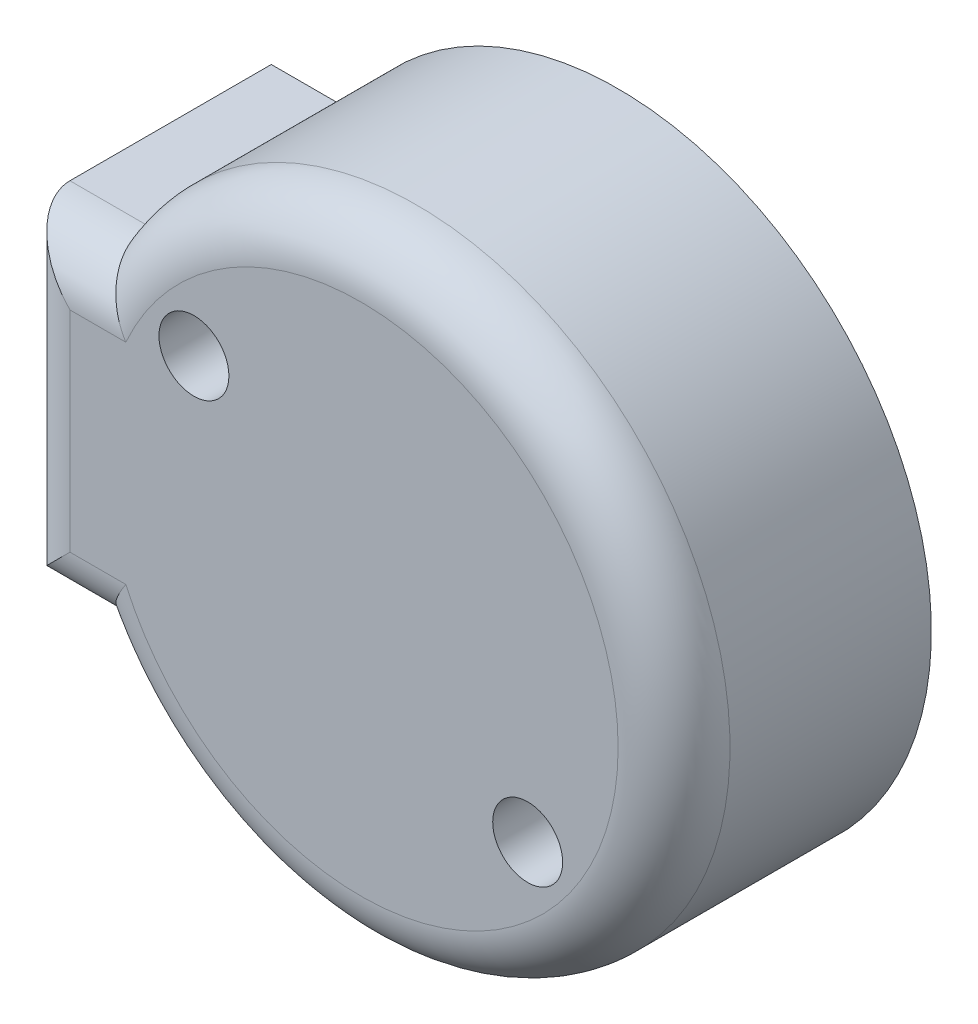
ISO-10303-21;
HEADER;
FILE_DESCRIPTION(('STEP AP214'),'2;1');
FILE_NAME('part.step','',(''),(''),'','','');
FILE_SCHEMA(('AUTOMOTIVE_DESIGN { 1 0 10303 214 1 1 1 1 }'));
ENDSEC;
DATA;
#1=APPLICATION_CONTEXT('core data for automotive mechanical design processes');
#2=APPLICATION_PROTOCOL_DEFINITION('international standard','automotive_design',2000,#1);
#3=PRODUCT_CONTEXT('',#1,'mechanical');
#4=PRODUCT('Part','Part','',(#3));
#5=PRODUCT_RELATED_PRODUCT_CATEGORY('part','',(#4));
#6=PRODUCT_DEFINITION_FORMATION('','',#4);
#7=PRODUCT_DEFINITION_CONTEXT('part definition',#1,'design');
#8=PRODUCT_DEFINITION('design','',#6,#7);
#9=PRODUCT_DEFINITION_SHAPE('','',#8);
#10=(LENGTH_UNIT() NAMED_UNIT(*) SI_UNIT(.MILLI.,.METRE.));
#11=(NAMED_UNIT(*) PLANE_ANGLE_UNIT() SI_UNIT($,.RADIAN.));
#12=(NAMED_UNIT(*) SI_UNIT($,.STERADIAN.) SOLID_ANGLE_UNIT());
#13=UNCERTAINTY_MEASURE_WITH_UNIT(LENGTH_MEASURE(1.E-05),#10,'distance_accuracy_value','');
#14=(GEOMETRIC_REPRESENTATION_CONTEXT(3) GLOBAL_UNCERTAINTY_ASSIGNED_CONTEXT((#13)) GLOBAL_UNIT_ASSIGNED_CONTEXT((#10,
#11,#12)) REPRESENTATION_CONTEXT('',''));
#15=CARTESIAN_POINT('',(0.,0.,0.));
#16=DIRECTION('',(0.,0.,1.));
#17=DIRECTION('',(1.,0.,0.));
#18=AXIS2_PLACEMENT_3D('',#15,#16,#17);
#19=CARTESIAN_POINT('',(0.,0.,11.684));
#20=DIRECTION('',(0.,0.,-1.));
#21=DIRECTION('',(-1.,0.,0.));
#22=AXIS2_PLACEMENT_3D('',#19,#20,#21);
#23=CYLINDRICAL_SURFACE('',#22,14.224);
#24=DIRECTION('',(0.,0.,-1.));
#25=VECTOR('',#24,1.);
#26=CARTESIAN_POINT('',(-12.2063782404938,7.3025,11.684));
#27=LINE('',#26,#25);
#28=CARTESIAN_POINT('',(-12.2063782404938,7.3025,0.));
#29=VERTEX_POINT('',#28);
#30=CARTESIAN_POINT('',(-12.2063782404938,7.3025,9.144));
#31=VERTEX_POINT('',#30);
#32=EDGE_CURVE('E116',#29,#31,#27,.F.);
#33=ORIENTED_EDGE('',*,*,#32,.T.);
#34=CARTESIAN_POINT('',(0.,0.,9.144));
#35=DIRECTION('',(0.,0.,1.));
#36=DIRECTION('',(1.,0.,0.));
#37=AXIS2_PLACEMENT_3D('',#34,#35,#36);
#38=CIRCLE('',#37,14.224);
#39=CARTESIAN_POINT('',(-12.2063782404938,-7.3025,9.144));
#40=VERTEX_POINT('',#39);
#41=EDGE_CURVE('E11',#31,#40,#38,.F.);
#42=ORIENTED_EDGE('',*,*,#41,.T.);
#43=DIRECTION('',(0.,0.,-1.));
#44=VECTOR('',#43,1.);
#45=CARTESIAN_POINT('',(-12.2063782404938,-7.3025,11.684));
#46=LINE('',#45,#44);
#47=CARTESIAN_POINT('',(-12.2063782404938,-7.3025,0.));
#48=VERTEX_POINT('',#47);
#49=EDGE_CURVE('E99',#40,#48,#46,.T.);
#50=ORIENTED_EDGE('',*,*,#49,.T.);
#51=CARTESIAN_POINT('',(0.,0.,0.));
#52=DIRECTION('',(0.,0.,1.));
#53=DIRECTION('',(1.,0.,0.));
#54=AXIS2_PLACEMENT_3D('',#51,#52,#53);
#55=CIRCLE('',#54,14.224);
#56=EDGE_CURVE('E95',#48,#29,#55,.T.);
#57=ORIENTED_EDGE('',*,*,#56,.T.);
#58=EDGE_LOOP('',(#33,#42,#50,#57));
#59=FACE_BOUND('',#58,.T.);
#60=ADVANCED_FACE('F33',(#59),#23,.T.);
#61=CARTESIAN_POINT('',(0.,0.,11.684));
#62=DIRECTION('',(0.,0.,1.));
#63=DIRECTION('',(1.,0.,0.));
#64=AXIS2_PLACEMENT_3D('',#61,#62,#63);
#65=PLANE('',#64);
#66=CARTESIAN_POINT('',(-7.57688490514292,5.77203951253085,11.684));
#67=DIRECTION('',(0.,0.,1.));
#68=DIRECTION('',(1.,0.,0.));
#69=AXIS2_PLACEMENT_3D('',#66,#67,#68);
#70=CIRCLE('',#69,1.5875);
#71=CARTESIAN_POINT('',(-5.98938490514292,5.77203951253085,11.684));
#72=VERTEX_POINT('',#71);
#73=EDGE_CURVE('E140',#72,#72,#70,.F.);
#74=ORIENTED_EDGE('',*,*,#73,.T.);
#75=EDGE_LOOP('',(#74));
#76=FACE_BOUND('',#75,.T.);
#77=CARTESIAN_POINT('',(7.57688490514292,-5.77203951253086,11.684));
#78=DIRECTION('',(0.,0.,1.));
#79=DIRECTION('',(1.,0.,0.));
#80=AXIS2_PLACEMENT_3D('',#77,#78,#79);
#81=CIRCLE('',#80,1.5875);
#82=CARTESIAN_POINT('',(9.16438490514292,-5.77203951253086,11.684));
#83=VERTEX_POINT('',#82);
#84=EDGE_CURVE('E173',#83,#83,#81,.F.);
#85=ORIENTED_EDGE('',*,*,#84,.T.);
#86=EDGE_LOOP('',(#85));
#87=FACE_BOUND('',#86,.T.);
#88=DIRECTION('',(0.,-1.,0.));
#89=VECTOR('',#88,1.);
#90=CARTESIAN_POINT('',(-13.208,0.,11.684));
#91=LINE('',#90,#89);
#92=CARTESIAN_POINT('',(-13.208,4.7625,11.684));
#93=VERTEX_POINT('',#92);
#94=CARTESIAN_POINT('',(-13.208,-4.7625,11.684));
#95=VERTEX_POINT('',#94);
#96=EDGE_CURVE('E123',#93,#95,#91,.T.);
#97=ORIENTED_EDGE('',*,*,#96,.T.);
#98=DIRECTION('',(1.,0.,0.));
#99=VECTOR('',#98,1.);
#100=CARTESIAN_POINT('',(0.,-4.7625,11.684));
#101=LINE('',#100,#99);
#102=CARTESIAN_POINT('',(-10.6693228346508,-4.7625,11.684));
#103=VERTEX_POINT('',#102);
#104=EDGE_CURVE('E125',#95,#103,#101,.T.);
#105=ORIENTED_EDGE('',*,*,#104,.T.);
#106=CARTESIAN_POINT('',(0.,0.,11.684));
#107=DIRECTION('',(0.,0.,1.));
#108=DIRECTION('',(1.,0.,0.));
#109=AXIS2_PLACEMENT_3D('',#106,#107,#108);
#110=CIRCLE('',#109,11.684);
#111=CARTESIAN_POINT('',(-10.6693228346508,4.7625,11.684));
#112=VERTEX_POINT('',#111);
#113=EDGE_CURVE('E119',#103,#112,#110,.T.);
#114=ORIENTED_EDGE('',*,*,#113,.T.);
#115=DIRECTION('',(-1.,0.,0.));
#116=VECTOR('',#115,1.);
#117=CARTESIAN_POINT('',(0.,4.7625,11.684));
#118=LINE('',#117,#116);
#119=EDGE_CURVE('E121',#112,#93,#118,.T.);
#120=ORIENTED_EDGE('',*,*,#119,.T.);
#121=EDGE_LOOP('',(#97,#105,#114,#120));
#122=FACE_BOUND('',#121,.T.);
#123=ADVANCED_FACE('F190',(#76,#87,#122),#65,.T.);
#124=CARTESIAN_POINT('',(0.,0.,0.));
#125=DIRECTION('',(0.,0.,1.));
#126=DIRECTION('',(1.,0.,0.));
#127=AXIS2_PLACEMENT_3D('',#124,#125,#126);
#128=PLANE('',#127);
#129=CARTESIAN_POINT('',(-7.57688490514292,5.77203951253085,0.));
#130=DIRECTION('',(0.,0.,-1.));
#131=DIRECTION('',(-1.,0.,0.));
#132=AXIS2_PLACEMENT_3D('',#129,#130,#131);
#133=CIRCLE('',#132,1.5875);
#134=CARTESIAN_POINT('',(-9.16438490514292,5.77203951253085,0.));
#135=VERTEX_POINT('',#134);
#136=EDGE_CURVE('E176',#135,#135,#133,.T.);
#137=ORIENTED_EDGE('',*,*,#136,.F.);
#138=EDGE_LOOP('',(#137));
#139=FACE_BOUND('',#138,.T.);
#140=CARTESIAN_POINT('',(7.57688490514292,-5.77203951253086,0.));
#141=DIRECTION('',(0.,0.,-1.));
#142=DIRECTION('',(-1.,0.,0.));
#143=AXIS2_PLACEMENT_3D('',#140,#141,#142);
#144=CIRCLE('',#143,1.5875);
#145=CARTESIAN_POINT('',(5.98938490514292,-5.77203951253086,0.));
#146=VERTEX_POINT('',#145);
#147=EDGE_CURVE('E177',#146,#146,#144,.T.);
#148=ORIENTED_EDGE('',*,*,#147,.F.);
#149=EDGE_LOOP('',(#148));
#150=FACE_BOUND('',#149,.T.);
#151=ORIENTED_EDGE('',*,*,#56,.F.);
#152=DIRECTION('',(-1.,0.,0.));
#153=VECTOR('',#152,1.);
#154=CARTESIAN_POINT('',(-15.748,-7.3025,0.));
#155=LINE('',#154,#153);
#156=CARTESIAN_POINT('',(-15.748,-7.3025,0.));
#157=VERTEX_POINT('',#156);
#158=EDGE_CURVE('E89',#48,#157,#155,.T.);
#159=ORIENTED_EDGE('',*,*,#158,.T.);
#160=DIRECTION('',(0.,1.,0.));
#161=VECTOR('',#160,1.);
#162=CARTESIAN_POINT('',(-15.748,7.3025,0.));
#163=LINE('',#162,#161);
#164=CARTESIAN_POINT('',(-15.748,7.3025,0.));
#165=VERTEX_POINT('',#164);
#166=EDGE_CURVE('E93',#157,#165,#163,.T.);
#167=ORIENTED_EDGE('',*,*,#166,.T.);
#168=DIRECTION('',(1.,0.,0.));
#169=VECTOR('',#168,1.);
#170=CARTESIAN_POINT('',(-15.748,7.3025,0.));
#171=LINE('',#170,#169);
#172=EDGE_CURVE('E104',#165,#29,#171,.T.);
#173=ORIENTED_EDGE('',*,*,#172,.T.);
#174=EDGE_LOOP('',(#151,#159,#167,#173));
#175=FACE_BOUND('',#174,.T.);
#176=ADVANCED_FACE('F91',(#139,#150,#175),#128,.F.);
#177=CARTESIAN_POINT('',(-15.748,7.3025,-18.2016148109216));
#178=DIRECTION('',(0.,1.,0.));
#179=DIRECTION('',(0.,0.,1.));
#180=AXIS2_PLACEMENT_3D('',#177,#178,#179);
#181=PLANE('',#180);
#182=DIRECTION('',(0.,0.,1.));
#183=VECTOR('',#182,1.);
#184=CARTESIAN_POINT('',(-15.748,7.3025,-18.2016148109216));
#185=LINE('',#184,#183);
#186=CARTESIAN_POINT('',(-15.748,7.3025,9.14399999999999));
#187=VERTEX_POINT('',#186);
#188=EDGE_CURVE('E103',#165,#187,#185,.T.);
#189=ORIENTED_EDGE('',*,*,#188,.T.);
#190=DIRECTION('',(-1.,0.,0.));
#191=VECTOR('',#190,1.);
#192=CARTESIAN_POINT('',(-15.748,7.3025,9.144));
#193=LINE('',#192,#191);
#194=EDGE_CURVE('E42',#187,#31,#193,.F.);
#195=ORIENTED_EDGE('',*,*,#194,.T.);
#196=ORIENTED_EDGE('',*,*,#32,.F.);
#197=ORIENTED_EDGE('',*,*,#172,.F.);
#198=EDGE_LOOP('',(#189,#195,#196,#197));
#199=FACE_BOUND('',#198,.T.);
#200=ADVANCED_FACE('F170',(#199),#181,.T.);
#201=CARTESIAN_POINT('',(-15.748,-7.3025,-18.2016148109216));
#202=DIRECTION('',(0.,-1.,0.));
#203=DIRECTION('',(0.,0.,-1.));
#204=AXIS2_PLACEMENT_3D('',#201,#202,#203);
#205=PLANE('',#204);
#206=ORIENTED_EDGE('',*,*,#49,.F.);
#207=DIRECTION('',(1.,0.,0.));
#208=VECTOR('',#207,1.);
#209=CARTESIAN_POINT('',(-15.748,-7.3025,9.144));
#210=LINE('',#209,#208);
#211=CARTESIAN_POINT('',(-15.748,-7.3025,9.14399999999999));
#212=VERTEX_POINT('',#211);
#213=EDGE_CURVE('E109',#40,#212,#210,.F.);
#214=ORIENTED_EDGE('',*,*,#213,.T.);
#215=DIRECTION('',(0.,0.,1.));
#216=VECTOR('',#215,1.);
#217=CARTESIAN_POINT('',(-15.748,-7.3025,-18.2016148109216));
#218=LINE('',#217,#216);
#219=EDGE_CURVE('E102',#157,#212,#218,.T.);
#220=ORIENTED_EDGE('',*,*,#219,.F.);
#221=ORIENTED_EDGE('',*,*,#158,.F.);
#222=EDGE_LOOP('',(#206,#214,#220,#221));
#223=FACE_BOUND('',#222,.T.);
#224=ADVANCED_FACE('F107',(#223),#205,.T.);
#225=CARTESIAN_POINT('',(-15.748,7.3025,-18.2016148109216));
#226=DIRECTION('',(-1.,0.,0.));
#227=DIRECTION('',(0.,0.,1.));
#228=AXIS2_PLACEMENT_3D('',#225,#226,#227);
#229=PLANE('',#228);
#230=ORIENTED_EDGE('',*,*,#219,.T.);
#231=DIRECTION('',(0.,-1.,0.));
#232=VECTOR('',#231,1.);
#233=CARTESIAN_POINT('',(-15.748,7.3025,9.144));
#234=LINE('',#233,#232);
#235=EDGE_CURVE('E57',#212,#187,#234,.F.);
#236=ORIENTED_EDGE('',*,*,#235,.T.);
#237=ORIENTED_EDGE('',*,*,#188,.F.);
#238=ORIENTED_EDGE('',*,*,#166,.F.);
#239=EDGE_LOOP('',(#230,#236,#237,#238));
#240=FACE_BOUND('',#239,.T.);
#241=ADVANCED_FACE('F101',(#240),#229,.T.);
#242=CARTESIAN_POINT('',(0.,4.7625,9.144));
#243=DIRECTION('',(-1.,0.,0.));
#244=DIRECTION('',(0.,0.,1.));
#245=AXIS2_PLACEMENT_3D('',#242,#243,#244);
#246=CYLINDRICAL_SURFACE('',#245,2.54);
#247=CARTESIAN_POINT('',(-12.2063782404938,7.3025,9.144));
#248=CARTESIAN_POINT('',(-12.2063833765361,7.30251081629843,9.20860770756605));
#249=CARTESIAN_POINT('',(-12.2049805851282,7.30003521513991,9.27320953147759));
#250=CARTESIAN_POINT('',(-12.1993987873526,7.29019390975039,9.40190017036242));
#251=CARTESIAN_POINT('',(-12.1952206079676,7.28282966219015,9.46598913239787));
#252=CARTESIAN_POINT('',(-12.1841493688148,7.26333198815409,9.59294259577827));
#253=CARTESIAN_POINT('',(-12.1772670135071,7.2512173663771,9.65581091164732));
#254=CARTESIAN_POINT('',(-12.1608676394844,7.22238479304907,9.78011620632616));
#255=CARTESIAN_POINT('',(-12.15135052612,7.20566667612517,9.8415531336297));
#256=CARTESIAN_POINT('',(-12.1189967105256,7.14891629740216,10.0229897657637));
#257=CARTESIAN_POINT('',(-12.0923389608859,7.10225511055377,10.1403248119491));
#258=CARTESIAN_POINT('',(-12.0298489863483,6.99336369932156,10.3648454021488));
#259=CARTESIAN_POINT('',(-11.9940101563639,6.93112226688021,10.4720235626916));
#260=CARTESIAN_POINT('',(-11.9124583563322,6.79027427562904,10.678962240616));
#261=CARTESIAN_POINT('',(-11.866362535423,6.71103938648053,10.7781429064421));
#262=CARTESIAN_POINT('',(-11.7667788916754,6.54102753212032,10.9617221247867));
#263=CARTESIAN_POINT('',(-11.7132893738305,6.45024792066151,11.0461172776352));
#264=CARTESIAN_POINT('',(-11.5933219031135,6.24820741695659,11.2087205144632));
#265=CARTESIAN_POINT('',(-11.5260554980578,6.13579894280917,11.2849181104718));
#266=CARTESIAN_POINT('',(-11.3855121958088,5.90318412353233,11.4174096072657));
#267=CARTESIAN_POINT('',(-11.3122286096649,5.7829691322507,11.4736809778768));
#268=CARTESIAN_POINT('',(-11.1477296439593,5.51591470024551,11.574600980046));
#269=CARTESIAN_POINT('',(-11.0556477219521,5.36815173498054,11.6153847083596));
#270=CARTESIAN_POINT('',(-10.8676592168761,5.07043593031911,11.6697902653141));
#271=CARTESIAN_POINT('',(-10.7717603982454,4.92048789410155,11.6834646218654));
#272=CARTESIAN_POINT('',(-10.6731495417006,4.7683995622048,11.6839948686613));
#273=CARTESIAN_POINT('',(-10.6712363399099,4.76544961470523,11.6840000068502));
#274=CARTESIAN_POINT('',(-10.6693228346508,4.7625,11.684));
#275=B_SPLINE_CURVE_WITH_KNOTS('',3,(#247,#248,#249,#250,#251,#252,#253,#254,#255,#256,#257,
#258,#259,#260,#261,#262,#263,#264,#265,#266,#267,#268,#269,#270,#271,#272,#273,#274),
.UNSPECIFIED.,.F.,.F.,(4,2,2,2,2,2,2,2,2,2,2,2,2,4),(0.,0.193750595615582,0.387443485232802,
0.580377244968128,0.773317936430625,1.15856885357873,1.54409771154427,1.94762421512522,
2.3512433811369,2.80409697276204,3.25746097389573,3.79171201234433,4.32492685467048,
4.3354749650833),.UNSPECIFIED.);
#276=EDGE_CURVE('E113',#31,#112,#275,.T.);
#277=ORIENTED_EDGE('',*,*,#276,.F.);
#278=ORIENTED_EDGE('',*,*,#194,.F.);
#279=CARTESIAN_POINT('',(-13.208,4.7625,9.144));
#280=DIRECTION('',(-0.707106781186547,-0.707106781186547,0.));
#281=DIRECTION('',(-0.707106781186547,0.707106781186547,0.));
#282=AXIS2_PLACEMENT_3D('',#279,#280,#281);
#283=ELLIPSE('',#282,3.59210244842766,2.54);
#284=EDGE_CURVE('E37',#93,#187,#283,.T.);
#285=ORIENTED_EDGE('',*,*,#284,.F.);
#286=ORIENTED_EDGE('',*,*,#119,.F.);
#287=EDGE_LOOP('',(#277,#278,#285,#286));
#288=FACE_BOUND('',#287,.T.);
#289=ADVANCED_FACE('F149',(#288),#246,.T.);
#290=CARTESIAN_POINT('',(-13.208,0.,9.144));
#291=DIRECTION('',(0.,-1.,0.));
#292=DIRECTION('',(0.,0.,-1.));
#293=AXIS2_PLACEMENT_3D('',#290,#291,#292);
#294=CYLINDRICAL_SURFACE('',#293,2.54);
#295=ORIENTED_EDGE('',*,*,#284,.T.);
#296=ORIENTED_EDGE('',*,*,#235,.F.);
#297=CARTESIAN_POINT('',(-13.208,-4.7625,9.144));
#298=DIRECTION('',(0.707106781186547,-0.707106781186547,0.));
#299=DIRECTION('',(-0.707106781186547,-0.707106781186547,0.));
#300=AXIS2_PLACEMENT_3D('',#297,#298,#299);
#301=ELLIPSE('',#300,3.59210244842766,2.54);
#302=EDGE_CURVE('E139',#95,#212,#301,.T.);
#303=ORIENTED_EDGE('',*,*,#302,.F.);
#304=ORIENTED_EDGE('',*,*,#96,.F.);
#305=EDGE_LOOP('',(#295,#296,#303,#304));
#306=FACE_BOUND('',#305,.T.);
#307=ADVANCED_FACE('F35',(#306),#294,.T.);
#308=CARTESIAN_POINT('',(0.,0.,9.144));
#309=DIRECTION('',(0.,0.,1.));
#310=DIRECTION('',(1.,0.,0.));
#311=AXIS2_PLACEMENT_3D('',#308,#309,#310);
#312=TOROIDAL_SURFACE('',#311,11.684,2.54);
#313=ORIENTED_EDGE('',*,*,#276,.T.);
#314=ORIENTED_EDGE('',*,*,#113,.F.);
#315=CARTESIAN_POINT('',(-12.2063782404938,-7.3025,9.144));
#316=CARTESIAN_POINT('',(-12.2063833765361,-7.30251081629843,9.20860770756605));
#317=CARTESIAN_POINT('',(-12.2049805851282,-7.30003521513991,9.27320953147759));
#318=CARTESIAN_POINT('',(-12.1993987873526,-7.29019390975039,9.40190017036242));
#319=CARTESIAN_POINT('',(-12.1952206079676,-7.28282966219015,9.46598913239787));
#320=CARTESIAN_POINT('',(-12.1841493688148,-7.26333198815409,9.59294259577827));
#321=CARTESIAN_POINT('',(-12.1772670135071,-7.2512173663771,9.65581091164732));
#322=CARTESIAN_POINT('',(-12.1608676394844,-7.22238479304907,9.78011620632616));
#323=CARTESIAN_POINT('',(-12.15135052612,-7.20566667612517,9.8415531336297));
#324=CARTESIAN_POINT('',(-12.1189967105256,-7.14891629740216,10.0229897657637));
#325=CARTESIAN_POINT('',(-12.0923389608859,-7.10225511055377,10.1403248119491));
#326=CARTESIAN_POINT('',(-12.0298489863483,-6.99336369932156,10.3648454021488));
#327=CARTESIAN_POINT('',(-11.9940101563639,-6.93112226688021,10.4720235626916));
#328=CARTESIAN_POINT('',(-11.9124583563322,-6.79027427562904,10.678962240616));
#329=CARTESIAN_POINT('',(-11.866362535423,-6.71103938648053,10.7781429064421));
#330=CARTESIAN_POINT('',(-11.7667788916754,-6.54102753212032,10.9617221247867));
#331=CARTESIAN_POINT('',(-11.7132893738305,-6.45024792066151,11.0461172776352));
#332=CARTESIAN_POINT('',(-11.5933219031135,-6.24820741695659,11.2087205144632));
#333=CARTESIAN_POINT('',(-11.5260554980578,-6.13579894280917,11.2849181104718));
#334=CARTESIAN_POINT('',(-11.3855121958088,-5.90318412353233,11.4174096072657));
#335=CARTESIAN_POINT('',(-11.3122286096649,-5.7829691322507,11.4736809778768));
#336=CARTESIAN_POINT('',(-11.1477296439593,-5.51591470024551,11.574600980046));
#337=CARTESIAN_POINT('',(-11.0556477219521,-5.36815173498054,11.6153847083596));
#338=CARTESIAN_POINT('',(-10.8676592168761,-5.07043593031911,11.6697902653141));
#339=CARTESIAN_POINT('',(-10.7717603982454,-4.92048789410155,11.6834646218654));
#340=CARTESIAN_POINT('',(-10.6731495417006,-4.7683995622048,11.6839948686613));
#341=CARTESIAN_POINT('',(-10.6712363399099,-4.76544961470523,11.6840000068502));
#342=CARTESIAN_POINT('',(-10.6693228346508,-4.7625,11.684));
#343=B_SPLINE_CURVE_WITH_KNOTS('',3,(#315,#316,#317,#318,#319,#320,#321,#322,#323,#324,#325,
#326,#327,#328,#329,#330,#331,#332,#333,#334,#335,#336,#337,#338,#339,#340,#341,#342),
.UNSPECIFIED.,.F.,.F.,(4,2,2,2,2,2,2,2,2,2,2,2,2,4),(0.,0.193750595615582,0.387443485232802,
0.580377244968128,0.773317936430625,1.15856885357873,1.54409771154427,1.94762421512522,
2.3512433811369,2.80409697276204,3.25746097389573,3.79171201234433,4.32492685467048,
4.3354749650833),.UNSPECIFIED.);
#344=EDGE_CURVE('E131',#40,#103,#343,.T.);
#345=ORIENTED_EDGE('',*,*,#344,.F.);
#346=ORIENTED_EDGE('',*,*,#41,.F.);
#347=EDGE_LOOP('',(#313,#314,#345,#346));
#348=FACE_BOUND('',#347,.T.);
#349=ADVANCED_FACE('F141',(#348),#312,.T.);
#350=CARTESIAN_POINT('',(0.,-4.7625,9.144));
#351=DIRECTION('',(1.,0.,0.));
#352=DIRECTION('',(0.,0.,-1.));
#353=AXIS2_PLACEMENT_3D('',#350,#351,#352);
#354=CYLINDRICAL_SURFACE('',#353,2.54);
#355=ORIENTED_EDGE('',*,*,#302,.T.);
#356=ORIENTED_EDGE('',*,*,#213,.F.);
#357=ORIENTED_EDGE('',*,*,#344,.T.);
#358=ORIENTED_EDGE('',*,*,#104,.F.);
#359=EDGE_LOOP('',(#355,#356,#357,#358));
#360=FACE_BOUND('',#359,.T.);
#361=ADVANCED_FACE('F144',(#360),#354,.T.);
#362=CARTESIAN_POINT('',(7.57688490514292,-5.77203951253086,16.1741280605346));
#363=DIRECTION('',(0.,0.,-1.));
#364=DIRECTION('',(-1.,0.,0.));
#365=AXIS2_PLACEMENT_3D('',#362,#363,#364);
#366=CYLINDRICAL_SURFACE('',#365,1.5875);
#367=ORIENTED_EDGE('',*,*,#147,.T.);
#368=EDGE_LOOP('',(#367));
#369=FACE_BOUND('',#368,.T.);
#370=ORIENTED_EDGE('',*,*,#84,.F.);
#371=EDGE_LOOP('',(#370));
#372=FACE_BOUND('',#371,.T.);
#373=ADVANCED_FACE('F147',(#369,#372),#366,.F.);
#374=CARTESIAN_POINT('',(-7.57688490514292,5.77203951253085,16.1741280605346));
#375=DIRECTION('',(0.,0.,-1.));
#376=DIRECTION('',(-1.,0.,0.));
#377=AXIS2_PLACEMENT_3D('',#374,#375,#376);
#378=CYLINDRICAL_SURFACE('',#377,1.5875);
#379=ORIENTED_EDGE('',*,*,#136,.T.);
#380=EDGE_LOOP('',(#379));
#381=FACE_BOUND('',#380,.T.);
#382=ORIENTED_EDGE('',*,*,#73,.F.);
#383=EDGE_LOOP('',(#382));
#384=FACE_BOUND('',#383,.T.);
#385=ADVANCED_FACE('F185',(#381,#384),#378,.F.);
#386=CLOSED_SHELL('',(#60,#123,#176,#200,#224,#241,#289,#307,#349,#361,#373,#385));
#387=MANIFOLD_SOLID_BREP('B2',#386);
#388=ADVANCED_BREP_SHAPE_REPRESENTATION('',(#18,#387),#14);
#389=SHAPE_DEFINITION_REPRESENTATION(#9,#388);
ENDSEC;
END-ISO-10303-21;
